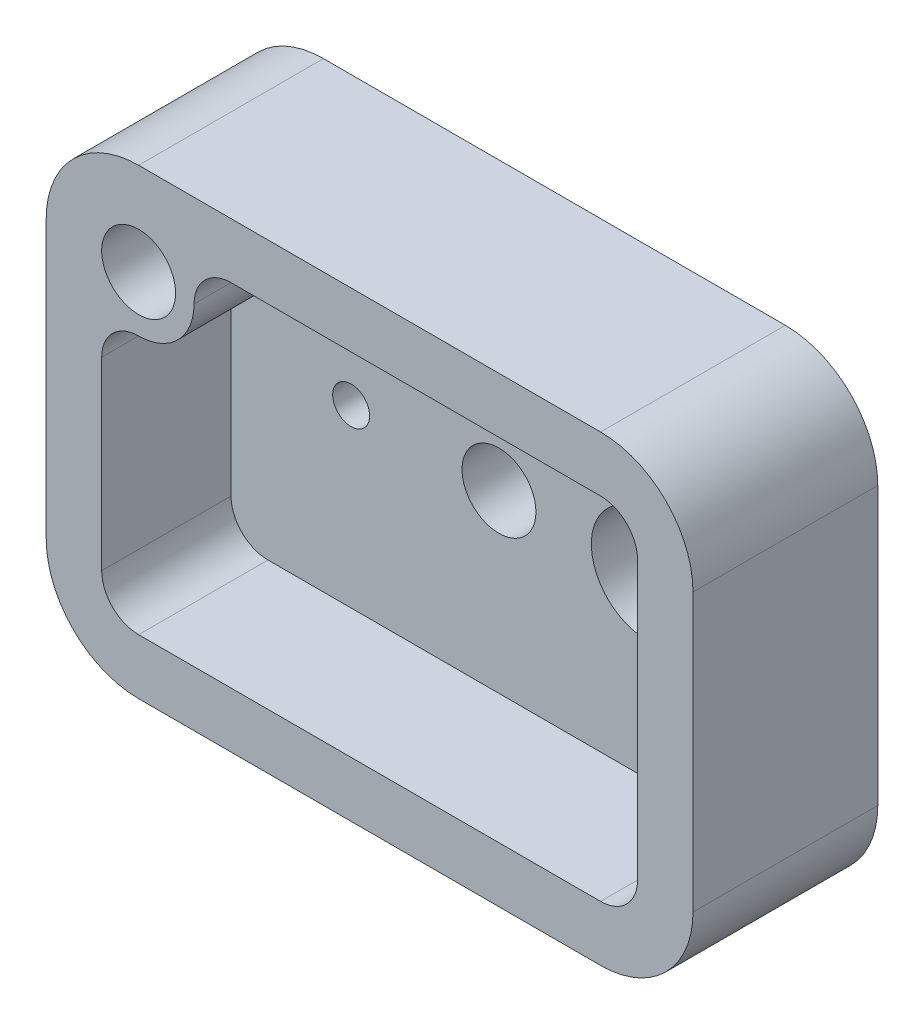
ISO-10303-21;
HEADER;
FILE_DESCRIPTION(('STEP AP214'),'2;1');
FILE_NAME('part.step','',(''),(''),'','','');
FILE_SCHEMA(('AUTOMOTIVE_DESIGN { 1 0 10303 214 1 1 1 1 }'));
ENDSEC;
DATA;
#1=APPLICATION_CONTEXT('core data for automotive mechanical design processes');
#2=APPLICATION_PROTOCOL_DEFINITION('international standard','automotive_design',2000,#1);
#3=PRODUCT_CONTEXT('',#1,'mechanical');
#4=PRODUCT('Part','Part','',(#3));
#5=PRODUCT_RELATED_PRODUCT_CATEGORY('part','',(#4));
#6=PRODUCT_DEFINITION_FORMATION('','',#4);
#7=PRODUCT_DEFINITION_CONTEXT('part definition',#1,'design');
#8=PRODUCT_DEFINITION('design','',#6,#7);
#9=PRODUCT_DEFINITION_SHAPE('','',#8);
#10=(LENGTH_UNIT() NAMED_UNIT(*) SI_UNIT(.MILLI.,.METRE.));
#11=(NAMED_UNIT(*) PLANE_ANGLE_UNIT() SI_UNIT($,.RADIAN.));
#12=(NAMED_UNIT(*) SI_UNIT($,.STERADIAN.) SOLID_ANGLE_UNIT());
#13=UNCERTAINTY_MEASURE_WITH_UNIT(LENGTH_MEASURE(1.E-05),#10,'distance_accuracy_value','');
#14=(GEOMETRIC_REPRESENTATION_CONTEXT(3) GLOBAL_UNCERTAINTY_ASSIGNED_CONTEXT((#13)) GLOBAL_UNIT_ASSIGNED_CONTEXT((#10,
#11,#12)) REPRESENTATION_CONTEXT('',''));
#15=CARTESIAN_POINT('',(0.,0.,0.));
#16=DIRECTION('',(0.,0.,1.));
#17=DIRECTION('',(1.,0.,0.));
#18=AXIS2_PLACEMENT_3D('',#15,#16,#17);
#19=CARTESIAN_POINT('',(17.5,12.5,0.));
#20=DIRECTION('',(0.,0.,1.));
#21=DIRECTION('',(1.,0.,0.));
#22=AXIS2_PLACEMENT_3D('',#19,#20,#21);
#23=PLANE('',#22);
#24=CARTESIAN_POINT('',(5.,20.,0.));
#25=DIRECTION('',(0.,0.,1.));
#26=DIRECTION('',(1.,0.,0.));
#27=AXIS2_PLACEMENT_3D('',#24,#25,#26);
#28=CIRCLE('',#27,2.);
#29=CARTESIAN_POINT('',(7.,20.,0.));
#30=VERTEX_POINT('',#29);
#31=EDGE_CURVE('E237',#30,#30,#28,.T.);
#32=ORIENTED_EDGE('',*,*,#31,.T.);
#33=EDGE_LOOP('',(#32));
#34=FACE_BOUND('',#33,.T.);
#35=ADVANCED_FACE('F47',(#34),#23,.T.);
#36=CARTESIAN_POINT('',(17.5,12.5,0.));
#37=DIRECTION('',(0.,0.,1.));
#38=DIRECTION('',(1.,0.,0.));
#39=AXIS2_PLACEMENT_3D('',#36,#37,#38);
#40=CIRCLE('',#39,2.);
#41=CARTESIAN_POINT('',(19.5,12.5,0.));
#42=VERTEX_POINT('',#41);
#43=EDGE_CURVE('E631',#42,#42,#40,.T.);
#44=ORIENTED_EDGE('',*,*,#43,.F.);
#45=EDGE_LOOP('',(#44));
#46=FACE_BOUND('',#45,.T.);
#47=CARTESIAN_POINT('',(9.49999999999999,12.5,0.));
#48=DIRECTION('',(0.,0.,1.));
#49=DIRECTION('',(1.,0.,0.));
#50=AXIS2_PLACEMENT_3D('',#47,#48,#49);
#51=CIRCLE('',#50,1.);
#52=CARTESIAN_POINT('',(10.5,12.5,0.));
#53=VERTEX_POINT('',#52);
#54=EDGE_CURVE('E628',#53,#53,#51,.T.);
#55=ORIENTED_EDGE('',*,*,#54,.F.);
#56=EDGE_LOOP('',(#55));
#57=FACE_BOUND('',#56,.T.);
#58=CARTESIAN_POINT('',(25.5,12.5,0.));
#59=DIRECTION('',(0.,0.,1.));
#60=DIRECTION('',(1.,0.,0.));
#61=AXIS2_PLACEMENT_3D('',#58,#59,#60);
#62=CIRCLE('',#61,3.);
#63=CARTESIAN_POINT('',(28.5,12.5,0.));
#64=VERTEX_POINT('',#63);
#65=EDGE_CURVE('E643',#64,#64,#62,.T.);
#66=ORIENTED_EDGE('',*,*,#65,.F.);
#67=EDGE_LOOP('',(#66));
#68=FACE_BOUND('',#67,.T.);
#69=DIRECTION('',(-1.,0.,0.));
#70=VECTOR('',#69,1.);
#71=CARTESIAN_POINT('',(17.5,22.,0.));
#72=LINE('',#71,#70);
#73=CARTESIAN_POINT('',(30.,22.,0.));
#74=VERTEX_POINT('',#73);
#75=CARTESIAN_POINT('',(10.,22.,0.));
#76=VERTEX_POINT('',#75);
#77=EDGE_CURVE('E255',#74,#76,#72,.T.);
#78=ORIENTED_EDGE('',*,*,#77,.T.);
#79=CARTESIAN_POINT('',(10.,20.,0.));
#80=DIRECTION('',(0.,0.,1.));
#81=DIRECTION('',(1.,0.,0.));
#82=AXIS2_PLACEMENT_3D('',#79,#80,#81);
#83=CIRCLE('',#82,2.);
#84=CARTESIAN_POINT('',(8.,20.,0.));
#85=VERTEX_POINT('',#84);
#86=EDGE_CURVE('E399',#76,#85,#83,.T.);
#87=ORIENTED_EDGE('',*,*,#86,.T.);
#88=CARTESIAN_POINT('',(5.,20.,0.));
#89=DIRECTION('',(0.,0.,1.));
#90=DIRECTION('',(1.,0.,0.));
#91=AXIS2_PLACEMENT_3D('',#88,#89,#90);
#92=CIRCLE('',#91,3.);
#93=CARTESIAN_POINT('',(5.,17.,0.));
#94=VERTEX_POINT('',#93);
#95=EDGE_CURVE('E220',#85,#94,#92,.F.);
#96=ORIENTED_EDGE('',*,*,#95,.T.);
#97=CARTESIAN_POINT('',(5.,15.,0.));
#98=DIRECTION('',(0.,0.,1.));
#99=DIRECTION('',(1.,0.,0.));
#100=AXIS2_PLACEMENT_3D('',#97,#98,#99);
#101=CIRCLE('',#100,2.);
#102=CARTESIAN_POINT('',(3.,15.,0.));
#103=VERTEX_POINT('',#102);
#104=EDGE_CURVE('E69',#94,#103,#101,.T.);
#105=ORIENTED_EDGE('',*,*,#104,.T.);
#106=DIRECTION('',(0.,-1.,0.));
#107=VECTOR('',#106,1.);
#108=CARTESIAN_POINT('',(3.,12.5,0.));
#109=LINE('',#108,#107);
#110=CARTESIAN_POINT('',(3.,5.,0.));
#111=VERTEX_POINT('',#110);
#112=EDGE_CURVE('E229',#103,#111,#109,.T.);
#113=ORIENTED_EDGE('',*,*,#112,.T.);
#114=CARTESIAN_POINT('',(5.,5.,0.));
#115=DIRECTION('',(0.,0.,1.));
#116=DIRECTION('',(1.,0.,0.));
#117=AXIS2_PLACEMENT_3D('',#114,#115,#116);
#118=CIRCLE('',#117,2.);
#119=CARTESIAN_POINT('',(5.,3.,0.));
#120=VERTEX_POINT('',#119);
#121=EDGE_CURVE('E318',#111,#120,#118,.T.);
#122=ORIENTED_EDGE('',*,*,#121,.T.);
#123=DIRECTION('',(1.,0.,0.));
#124=VECTOR('',#123,1.);
#125=CARTESIAN_POINT('',(17.5,3.,0.));
#126=LINE('',#125,#124);
#127=CARTESIAN_POINT('',(30.,3.,0.));
#128=VERTEX_POINT('',#127);
#129=EDGE_CURVE('E273',#120,#128,#126,.T.);
#130=ORIENTED_EDGE('',*,*,#129,.T.);
#131=CARTESIAN_POINT('',(30.,5.,0.));
#132=DIRECTION('',(0.,0.,1.));
#133=DIRECTION('',(1.,0.,0.));
#134=AXIS2_PLACEMENT_3D('',#131,#132,#133);
#135=CIRCLE('',#134,2.);
#136=CARTESIAN_POINT('',(32.,5.,0.));
#137=VERTEX_POINT('',#136);
#138=EDGE_CURVE('E236',#128,#137,#135,.T.);
#139=ORIENTED_EDGE('',*,*,#138,.T.);
#140=DIRECTION('',(0.,1.,0.));
#141=VECTOR('',#140,1.);
#142=CARTESIAN_POINT('',(32.,12.5,0.));
#143=LINE('',#142,#141);
#144=CARTESIAN_POINT('',(32.,20.,0.));
#145=VERTEX_POINT('',#144);
#146=EDGE_CURVE('E267',#137,#145,#143,.T.);
#147=ORIENTED_EDGE('',*,*,#146,.T.);
#148=CARTESIAN_POINT('',(30.,20.,0.));
#149=DIRECTION('',(0.,0.,1.));
#150=DIRECTION('',(1.,0.,0.));
#151=AXIS2_PLACEMENT_3D('',#148,#149,#150);
#152=CIRCLE('',#151,2.);
#153=EDGE_CURVE('E289',#145,#74,#152,.T.);
#154=ORIENTED_EDGE('',*,*,#153,.T.);
#155=EDGE_LOOP('',(#78,#87,#96,#105,#113,#122,#130,#139,#147,#154));
#156=FACE_BOUND('',#155,.T.);
#157=ADVANCED_FACE('F412',(#46,#57,#68,#156),#23,.T.);
#158=CARTESIAN_POINT('',(17.5,12.5,7.));
#159=DIRECTION('',(0.,0.,1.));
#160=DIRECTION('',(1.,0.,0.));
#161=AXIS2_PLACEMENT_3D('',#158,#159,#160);
#162=PLANE('',#161);
#163=CARTESIAN_POINT('',(5.,20.,7.));
#164=DIRECTION('',(0.,0.,1.));
#165=DIRECTION('',(1.,0.,0.));
#166=AXIS2_PLACEMENT_3D('',#163,#164,#165);
#167=CIRCLE('',#166,2.);
#168=CARTESIAN_POINT('',(7.,20.,7.));
#169=VERTEX_POINT('',#168);
#170=EDGE_CURVE('E241',#169,#169,#167,.T.);
#171=ORIENTED_EDGE('',*,*,#170,.F.);
#172=EDGE_LOOP('',(#171));
#173=FACE_BOUND('',#172,.T.);
#174=DIRECTION('',(1.,0.,0.));
#175=VECTOR('',#174,1.);
#176=CARTESIAN_POINT('',(17.5,25.,7.));
#177=LINE('',#176,#175);
#178=CARTESIAN_POINT('',(5.,25.,7.));
#179=VERTEX_POINT('',#178);
#180=CARTESIAN_POINT('',(30.,25.,7.));
#181=VERTEX_POINT('',#180);
#182=EDGE_CURVE('E363',#179,#181,#177,.T.);
#183=ORIENTED_EDGE('',*,*,#182,.F.);
#184=CARTESIAN_POINT('',(5.,20.,7.));
#185=DIRECTION('',(0.,0.,1.));
#186=DIRECTION('',(1.,0.,0.));
#187=AXIS2_PLACEMENT_3D('',#184,#185,#186);
#188=CIRCLE('',#187,5.);
#189=CARTESIAN_POINT('',(0.,20.,7.));
#190=VERTEX_POINT('',#189);
#191=EDGE_CURVE('E295',#179,#190,#188,.T.);
#192=ORIENTED_EDGE('',*,*,#191,.T.);
#193=DIRECTION('',(0.,1.,0.));
#194=VECTOR('',#193,1.);
#195=CARTESIAN_POINT('',(0.,12.5,7.));
#196=LINE('',#195,#194);
#197=CARTESIAN_POINT('',(0.,5.,7.));
#198=VERTEX_POINT('',#197);
#199=EDGE_CURVE('E260',#198,#190,#196,.T.);
#200=ORIENTED_EDGE('',*,*,#199,.F.);
#201=CARTESIAN_POINT('',(5.,5.,7.));
#202=DIRECTION('',(0.,0.,1.));
#203=DIRECTION('',(1.,0.,0.));
#204=AXIS2_PLACEMENT_3D('',#201,#202,#203);
#205=CIRCLE('',#204,5.);
#206=CARTESIAN_POINT('',(5.,0.,7.));
#207=VERTEX_POINT('',#206);
#208=EDGE_CURVE('E242',#198,#207,#205,.T.);
#209=ORIENTED_EDGE('',*,*,#208,.T.);
#210=DIRECTION('',(1.,0.,0.));
#211=VECTOR('',#210,1.);
#212=CARTESIAN_POINT('',(17.5,0.,7.));
#213=LINE('',#212,#211);
#214=CARTESIAN_POINT('',(30.,0.,7.));
#215=VERTEX_POINT('',#214);
#216=EDGE_CURVE('E311',#207,#215,#213,.T.);
#217=ORIENTED_EDGE('',*,*,#216,.T.);
#218=CARTESIAN_POINT('',(30.,5.,7.));
#219=DIRECTION('',(0.,0.,1.));
#220=DIRECTION('',(1.,0.,0.));
#221=AXIS2_PLACEMENT_3D('',#218,#219,#220);
#222=CIRCLE('',#221,5.);
#223=CARTESIAN_POINT('',(35.,5.,7.));
#224=VERTEX_POINT('',#223);
#225=EDGE_CURVE('E317',#215,#224,#222,.T.);
#226=ORIENTED_EDGE('',*,*,#225,.T.);
#227=DIRECTION('',(0.,1.,0.));
#228=VECTOR('',#227,1.);
#229=CARTESIAN_POINT('',(35.,12.5,7.));
#230=LINE('',#229,#228);
#231=CARTESIAN_POINT('',(35.,20.,7.));
#232=VERTEX_POINT('',#231);
#233=EDGE_CURVE('E288',#224,#232,#230,.T.);
#234=ORIENTED_EDGE('',*,*,#233,.T.);
#235=CARTESIAN_POINT('',(30.,20.,7.));
#236=DIRECTION('',(0.,0.,1.));
#237=DIRECTION('',(1.,0.,0.));
#238=AXIS2_PLACEMENT_3D('',#235,#236,#237);
#239=CIRCLE('',#238,5.);
#240=EDGE_CURVE('E287',#232,#181,#239,.T.);
#241=ORIENTED_EDGE('',*,*,#240,.T.);
#242=EDGE_LOOP('',(#183,#192,#200,#209,#217,#226,#234,#241));
#243=FACE_BOUND('',#242,.T.);
#244=CARTESIAN_POINT('',(30.,20.,7.));
#245=DIRECTION('',(0.,0.,1.));
#246=DIRECTION('',(1.,0.,0.));
#247=AXIS2_PLACEMENT_3D('',#244,#245,#246);
#248=CIRCLE('',#247,2.);
#249=CARTESIAN_POINT('',(32.,20.,7.));
#250=VERTEX_POINT('',#249);
#251=CARTESIAN_POINT('',(30.,22.,7.));
#252=VERTEX_POINT('',#251);
#253=EDGE_CURVE('E306',#250,#252,#248,.T.);
#254=ORIENTED_EDGE('',*,*,#253,.F.);
#255=DIRECTION('',(0.,1.,0.));
#256=VECTOR('',#255,1.);
#257=CARTESIAN_POINT('',(32.,12.5,7.));
#258=LINE('',#257,#256);
#259=CARTESIAN_POINT('',(32.,5.,7.));
#260=VERTEX_POINT('',#259);
#261=EDGE_CURVE('E266',#260,#250,#258,.T.);
#262=ORIENTED_EDGE('',*,*,#261,.F.);
#263=CARTESIAN_POINT('',(30.,5.,7.));
#264=DIRECTION('',(0.,0.,1.));
#265=DIRECTION('',(1.,0.,0.));
#266=AXIS2_PLACEMENT_3D('',#263,#264,#265);
#267=CIRCLE('',#266,2.);
#268=CARTESIAN_POINT('',(30.,3.,7.));
#269=VERTEX_POINT('',#268);
#270=EDGE_CURVE('E235',#269,#260,#267,.T.);
#271=ORIENTED_EDGE('',*,*,#270,.F.);
#272=DIRECTION('',(1.,0.,0.));
#273=VECTOR('',#272,1.);
#274=CARTESIAN_POINT('',(17.5,3.,7.));
#275=LINE('',#274,#273);
#276=CARTESIAN_POINT('',(5.,3.,7.));
#277=VERTEX_POINT('',#276);
#278=EDGE_CURVE('E272',#277,#269,#275,.T.);
#279=ORIENTED_EDGE('',*,*,#278,.F.);
#280=CARTESIAN_POINT('',(5.,5.,7.));
#281=DIRECTION('',(0.,0.,1.));
#282=DIRECTION('',(1.,0.,0.));
#283=AXIS2_PLACEMENT_3D('',#280,#281,#282);
#284=CIRCLE('',#283,2.);
#285=CARTESIAN_POINT('',(3.,5.,7.));
#286=VERTEX_POINT('',#285);
#287=EDGE_CURVE('E226',#286,#277,#284,.T.);
#288=ORIENTED_EDGE('',*,*,#287,.F.);
#289=DIRECTION('',(0.,-1.,0.));
#290=VECTOR('',#289,1.);
#291=CARTESIAN_POINT('',(3.,12.5,7.));
#292=LINE('',#291,#290);
#293=CARTESIAN_POINT('',(3.,15.,7.));
#294=VERTEX_POINT('',#293);
#295=EDGE_CURVE('E205',#294,#286,#292,.T.);
#296=ORIENTED_EDGE('',*,*,#295,.F.);
#297=CARTESIAN_POINT('',(5.,15.,7.));
#298=DIRECTION('',(0.,0.,1.));
#299=DIRECTION('',(1.,0.,0.));
#300=AXIS2_PLACEMENT_3D('',#297,#298,#299);
#301=CIRCLE('',#300,2.);
#302=CARTESIAN_POINT('',(5.,17.,7.));
#303=VERTEX_POINT('',#302);
#304=EDGE_CURVE('E11',#294,#303,#301,.F.);
#305=ORIENTED_EDGE('',*,*,#304,.T.);
#306=CARTESIAN_POINT('',(5.,20.,7.));
#307=DIRECTION('',(0.,0.,1.));
#308=DIRECTION('',(1.,0.,0.));
#309=AXIS2_PLACEMENT_3D('',#306,#307,#308);
#310=CIRCLE('',#309,3.);
#311=CARTESIAN_POINT('',(8.,20.,7.));
#312=VERTEX_POINT('',#311);
#313=EDGE_CURVE('E203',#303,#312,#310,.T.);
#314=ORIENTED_EDGE('',*,*,#313,.T.);
#315=CARTESIAN_POINT('',(10.,20.,7.));
#316=DIRECTION('',(0.,0.,1.));
#317=DIRECTION('',(1.,0.,0.));
#318=AXIS2_PLACEMENT_3D('',#315,#316,#317);
#319=CIRCLE('',#318,2.);
#320=CARTESIAN_POINT('',(10.,22.,7.));
#321=VERTEX_POINT('',#320);
#322=EDGE_CURVE('E56',#312,#321,#319,.F.);
#323=ORIENTED_EDGE('',*,*,#322,.T.);
#324=DIRECTION('',(-1.,0.,0.));
#325=VECTOR('',#324,1.);
#326=CARTESIAN_POINT('',(17.5,22.,7.));
#327=LINE('',#326,#325);
#328=EDGE_CURVE('E250',#252,#321,#327,.T.);
#329=ORIENTED_EDGE('',*,*,#328,.F.);
#330=EDGE_LOOP('',(#254,#262,#271,#279,#288,#296,#305,#314,#323,#329));
#331=FACE_BOUND('',#330,.T.);
#332=ADVANCED_FACE('F202',(#173,#243,#331),#162,.T.);
#333=CARTESIAN_POINT('',(17.5,22.,7.));
#334=DIRECTION('',(0.,-1.,0.));
#335=DIRECTION('',(0.,0.,-1.));
#336=AXIS2_PLACEMENT_3D('',#333,#334,#335);
#337=PLANE('',#336);
#338=ORIENTED_EDGE('',*,*,#328,.T.);
#339=DIRECTION('',(0.,0.,1.));
#340=VECTOR('',#339,1.);
#341=CARTESIAN_POINT('',(10.,22.,0.));
#342=LINE('',#341,#340);
#343=EDGE_CURVE('E254',#321,#76,#342,.F.);
#344=ORIENTED_EDGE('',*,*,#343,.T.);
#345=ORIENTED_EDGE('',*,*,#77,.F.);
#346=DIRECTION('',(0.,0.,-1.));
#347=VECTOR('',#346,1.);
#348=CARTESIAN_POINT('',(30.,22.,7.));
#349=LINE('',#348,#347);
#350=EDGE_CURVE('E302',#252,#74,#349,.T.);
#351=ORIENTED_EDGE('',*,*,#350,.F.);
#352=EDGE_LOOP('',(#338,#344,#345,#351));
#353=FACE_BOUND('',#352,.T.);
#354=ADVANCED_FACE('F409',(#353),#337,.T.);
#355=CARTESIAN_POINT('',(5.,20.,7.));
#356=DIRECTION('',(0.,0.,-1.));
#357=DIRECTION('',(-1.,0.,0.));
#358=AXIS2_PLACEMENT_3D('',#355,#356,#357);
#359=CYLINDRICAL_SURFACE('',#358,2.);
#360=ORIENTED_EDGE('',*,*,#31,.F.);
#361=EDGE_LOOP('',(#360));
#362=FACE_BOUND('',#361,.T.);
#363=ORIENTED_EDGE('',*,*,#170,.T.);
#364=EDGE_LOOP('',(#363));
#365=FACE_BOUND('',#364,.T.);
#366=ADVANCED_FACE('F439',(#362,#365),#359,.F.);
#367=CARTESIAN_POINT('',(3.,12.5,7.));
#368=DIRECTION('',(1.,0.,0.));
#369=DIRECTION('',(0.,1.,0.));
#370=AXIS2_PLACEMENT_3D('',#367,#368,#369);
#371=PLANE('',#370);
#372=ORIENTED_EDGE('',*,*,#112,.F.);
#373=DIRECTION('',(0.,0.,1.));
#374=VECTOR('',#373,1.);
#375=CARTESIAN_POINT('',(3.,15.,7.));
#376=LINE('',#375,#374);
#377=EDGE_CURVE('E402',#103,#294,#376,.T.);
#378=ORIENTED_EDGE('',*,*,#377,.T.);
#379=ORIENTED_EDGE('',*,*,#295,.T.);
#380=DIRECTION('',(0.,0.,-1.));
#381=VECTOR('',#380,1.);
#382=CARTESIAN_POINT('',(3.,5.,7.));
#383=LINE('',#382,#381);
#384=EDGE_CURVE('E230',#286,#111,#383,.T.);
#385=ORIENTED_EDGE('',*,*,#384,.T.);
#386=EDGE_LOOP('',(#372,#378,#379,#385));
#387=FACE_BOUND('',#386,.T.);
#388=ADVANCED_FACE('F437',(#387),#371,.T.);
#389=CARTESIAN_POINT('',(5.,5.,7.));
#390=DIRECTION('',(0.,0.,-1.));
#391=DIRECTION('',(-1.,0.,0.));
#392=AXIS2_PLACEMENT_3D('',#389,#390,#391);
#393=CYLINDRICAL_SURFACE('',#392,2.);
#394=ORIENTED_EDGE('',*,*,#121,.F.);
#395=ORIENTED_EDGE('',*,*,#384,.F.);
#396=ORIENTED_EDGE('',*,*,#287,.T.);
#397=DIRECTION('',(0.,0.,-1.));
#398=VECTOR('',#397,1.);
#399=CARTESIAN_POINT('',(5.,3.,7.));
#400=LINE('',#399,#398);
#401=EDGE_CURVE('E268',#277,#120,#400,.T.);
#402=ORIENTED_EDGE('',*,*,#401,.T.);
#403=EDGE_LOOP('',(#394,#395,#396,#402));
#404=FACE_BOUND('',#403,.T.);
#405=ADVANCED_FACE('F435',(#404),#393,.F.);
#406=CARTESIAN_POINT('',(17.5,3.,7.));
#407=DIRECTION('',(0.,1.,0.));
#408=DIRECTION('',(1.,0.,0.));
#409=AXIS2_PLACEMENT_3D('',#406,#407,#408);
#410=PLANE('',#409);
#411=ORIENTED_EDGE('',*,*,#129,.F.);
#412=ORIENTED_EDGE('',*,*,#401,.F.);
#413=ORIENTED_EDGE('',*,*,#278,.T.);
#414=DIRECTION('',(0.,0.,-1.));
#415=VECTOR('',#414,1.);
#416=CARTESIAN_POINT('',(30.,3.,7.));
#417=LINE('',#416,#415);
#418=EDGE_CURVE('E231',#269,#128,#417,.T.);
#419=ORIENTED_EDGE('',*,*,#418,.T.);
#420=EDGE_LOOP('',(#411,#412,#413,#419));
#421=FACE_BOUND('',#420,.T.);
#422=ADVANCED_FACE('F430',(#421),#410,.T.);
#423=CARTESIAN_POINT('',(30.,5.,7.));
#424=DIRECTION('',(0.,0.,-1.));
#425=DIRECTION('',(-1.,0.,0.));
#426=AXIS2_PLACEMENT_3D('',#423,#424,#425);
#427=CYLINDRICAL_SURFACE('',#426,2.);
#428=ORIENTED_EDGE('',*,*,#138,.F.);
#429=ORIENTED_EDGE('',*,*,#418,.F.);
#430=ORIENTED_EDGE('',*,*,#270,.T.);
#431=DIRECTION('',(0.,0.,-1.));
#432=VECTOR('',#431,1.);
#433=CARTESIAN_POINT('',(32.,5.,7.));
#434=LINE('',#433,#432);
#435=EDGE_CURVE('E262',#260,#137,#434,.T.);
#436=ORIENTED_EDGE('',*,*,#435,.T.);
#437=EDGE_LOOP('',(#428,#429,#430,#436));
#438=FACE_BOUND('',#437,.T.);
#439=ADVANCED_FACE('F427',(#438),#427,.F.);
#440=CARTESIAN_POINT('',(32.,12.5,7.));
#441=DIRECTION('',(-1.,0.,0.));
#442=DIRECTION('',(0.,0.,1.));
#443=AXIS2_PLACEMENT_3D('',#440,#441,#442);
#444=PLANE('',#443);
#445=ORIENTED_EDGE('',*,*,#146,.F.);
#446=ORIENTED_EDGE('',*,*,#435,.F.);
#447=ORIENTED_EDGE('',*,*,#261,.T.);
#448=DIRECTION('',(0.,0.,-1.));
#449=VECTOR('',#448,1.);
#450=CARTESIAN_POINT('',(32.,20.,7.));
#451=LINE('',#450,#449);
#452=EDGE_CURVE('E293',#250,#145,#451,.T.);
#453=ORIENTED_EDGE('',*,*,#452,.T.);
#454=EDGE_LOOP('',(#445,#446,#447,#453));
#455=FACE_BOUND('',#454,.T.);
#456=ADVANCED_FACE('F424',(#455),#444,.T.);
#457=CARTESIAN_POINT('',(30.,20.,7.));
#458=DIRECTION('',(0.,0.,-1.));
#459=DIRECTION('',(-1.,0.,0.));
#460=AXIS2_PLACEMENT_3D('',#457,#458,#459);
#461=CYLINDRICAL_SURFACE('',#460,2.);
#462=ORIENTED_EDGE('',*,*,#153,.F.);
#463=ORIENTED_EDGE('',*,*,#452,.F.);
#464=ORIENTED_EDGE('',*,*,#253,.T.);
#465=ORIENTED_EDGE('',*,*,#350,.T.);
#466=EDGE_LOOP('',(#462,#463,#464,#465));
#467=FACE_BOUND('',#466,.T.);
#468=ADVANCED_FACE('F415',(#467),#461,.F.);
#469=CARTESIAN_POINT('',(17.5,12.5,-3.));
#470=DIRECTION('',(0.,0.,1.));
#471=DIRECTION('',(1.,0.,0.));
#472=AXIS2_PLACEMENT_3D('',#469,#470,#471);
#473=PLANE('',#472);
#474=CARTESIAN_POINT('',(9.49999999999999,12.5,-3.));
#475=DIRECTION('',(0.,0.,1.));
#476=DIRECTION('',(1.,0.,0.));
#477=AXIS2_PLACEMENT_3D('',#474,#475,#476);
#478=CIRCLE('',#477,1.);
#479=CARTESIAN_POINT('',(10.5,12.5,-3.));
#480=VERTEX_POINT('',#479);
#481=EDGE_CURVE('E215',#480,#480,#478,.T.);
#482=ORIENTED_EDGE('',*,*,#481,.T.);
#483=EDGE_LOOP('',(#482));
#484=FACE_BOUND('',#483,.T.);
#485=CARTESIAN_POINT('',(17.5,12.5,-3.));
#486=DIRECTION('',(0.,0.,1.));
#487=DIRECTION('',(1.,0.,0.));
#488=AXIS2_PLACEMENT_3D('',#485,#486,#487);
#489=CIRCLE('',#488,2.);
#490=CARTESIAN_POINT('',(19.5,12.5,-3.));
#491=VERTEX_POINT('',#490);
#492=EDGE_CURVE('E637',#491,#491,#489,.T.);
#493=ORIENTED_EDGE('',*,*,#492,.T.);
#494=EDGE_LOOP('',(#493));
#495=FACE_BOUND('',#494,.T.);
#496=CARTESIAN_POINT('',(25.5,12.5,-3.));
#497=DIRECTION('',(0.,0.,1.));
#498=DIRECTION('',(1.,0.,0.));
#499=AXIS2_PLACEMENT_3D('',#496,#497,#498);
#500=CIRCLE('',#499,3.);
#501=CARTESIAN_POINT('',(28.5,12.5,-3.));
#502=VERTEX_POINT('',#501);
#503=EDGE_CURVE('E647',#502,#502,#500,.T.);
#504=ORIENTED_EDGE('',*,*,#503,.T.);
#505=EDGE_LOOP('',(#504));
#506=FACE_BOUND('',#505,.T.);
#507=DIRECTION('',(1.,0.,0.));
#508=VECTOR('',#507,1.);
#509=CARTESIAN_POINT('',(17.5,25.,-3.));
#510=LINE('',#509,#508);
#511=CARTESIAN_POINT('',(5.,25.,-3.));
#512=VERTEX_POINT('',#511);
#513=CARTESIAN_POINT('',(30.,25.,-3.));
#514=VERTEX_POINT('',#513);
#515=EDGE_CURVE('E274',#512,#514,#510,.T.);
#516=ORIENTED_EDGE('',*,*,#515,.T.);
#517=CARTESIAN_POINT('',(30.,20.,-3.));
#518=DIRECTION('',(0.,0.,1.));
#519=DIRECTION('',(1.,0.,0.));
#520=AXIS2_PLACEMENT_3D('',#517,#518,#519);
#521=CIRCLE('',#520,5.);
#522=CARTESIAN_POINT('',(35.,20.,-3.));
#523=VERTEX_POINT('',#522);
#524=EDGE_CURVE('E294',#523,#514,#521,.T.);
#525=ORIENTED_EDGE('',*,*,#524,.F.);
#526=DIRECTION('',(0.,1.,0.));
#527=VECTOR('',#526,1.);
#528=CARTESIAN_POINT('',(35.,12.5,-3.));
#529=LINE('',#528,#527);
#530=CARTESIAN_POINT('',(35.,5.,-3.));
#531=VERTEX_POINT('',#530);
#532=EDGE_CURVE('E283',#531,#523,#529,.T.);
#533=ORIENTED_EDGE('',*,*,#532,.F.);
#534=CARTESIAN_POINT('',(30.,5.,-3.));
#535=DIRECTION('',(0.,0.,1.));
#536=DIRECTION('',(1.,0.,0.));
#537=AXIS2_PLACEMENT_3D('',#534,#535,#536);
#538=CIRCLE('',#537,5.);
#539=CARTESIAN_POINT('',(30.,0.,-3.));
#540=VERTEX_POINT('',#539);
#541=EDGE_CURVE('E312',#540,#531,#538,.T.);
#542=ORIENTED_EDGE('',*,*,#541,.F.);
#543=DIRECTION('',(1.,0.,0.));
#544=VECTOR('',#543,1.);
#545=CARTESIAN_POINT('',(17.5,0.,-3.));
#546=LINE('',#545,#544);
#547=CARTESIAN_POINT('',(5.,0.,-3.));
#548=VERTEX_POINT('',#547);
#549=EDGE_CURVE('E321',#548,#540,#546,.T.);
#550=ORIENTED_EDGE('',*,*,#549,.F.);
#551=CARTESIAN_POINT('',(5.,5.,-3.));
#552=DIRECTION('',(0.,0.,1.));
#553=DIRECTION('',(1.,0.,0.));
#554=AXIS2_PLACEMENT_3D('',#551,#552,#553);
#555=CIRCLE('',#554,5.);
#556=CARTESIAN_POINT('',(0.,5.,-3.));
#557=VERTEX_POINT('',#556);
#558=EDGE_CURVE('E246',#557,#548,#555,.T.);
#559=ORIENTED_EDGE('',*,*,#558,.F.);
#560=DIRECTION('',(0.,1.,0.));
#561=VECTOR('',#560,1.);
#562=CARTESIAN_POINT('',(0.,12.5,-3.));
#563=LINE('',#562,#561);
#564=CARTESIAN_POINT('',(0.,20.,-3.));
#565=VERTEX_POINT('',#564);
#566=EDGE_CURVE('E280',#557,#565,#563,.T.);
#567=ORIENTED_EDGE('',*,*,#566,.T.);
#568=CARTESIAN_POINT('',(5.,20.,-3.));
#569=DIRECTION('',(0.,0.,1.));
#570=DIRECTION('',(1.,0.,0.));
#571=AXIS2_PLACEMENT_3D('',#568,#569,#570);
#572=CIRCLE('',#571,5.);
#573=EDGE_CURVE('E261',#512,#565,#572,.T.);
#574=ORIENTED_EDGE('',*,*,#573,.F.);
#575=EDGE_LOOP('',(#516,#525,#533,#542,#550,#559,#567,#574));
#576=FACE_BOUND('',#575,.T.);
#577=ADVANCED_FACE('F475',(#484,#495,#506,#576),#473,.F.);
#578=CARTESIAN_POINT('',(30.,20.,-3.));
#579=DIRECTION('',(0.,0.,1.));
#580=DIRECTION('',(1.,0.,0.));
#581=AXIS2_PLACEMENT_3D('',#578,#579,#580);
#582=CYLINDRICAL_SURFACE('',#581,5.);
#583=DIRECTION('',(0.,0.,1.));
#584=VECTOR('',#583,1.);
#585=CARTESIAN_POINT('',(30.,25.,-3.));
#586=LINE('',#585,#584);
#587=EDGE_CURVE('E279',#514,#181,#586,.T.);
#588=ORIENTED_EDGE('',*,*,#587,.T.);
#589=ORIENTED_EDGE('',*,*,#240,.F.);
#590=DIRECTION('',(0.,0.,1.));
#591=VECTOR('',#590,1.);
#592=CARTESIAN_POINT('',(35.,20.,-3.));
#593=LINE('',#592,#591);
#594=EDGE_CURVE('E316',#523,#232,#593,.T.);
#595=ORIENTED_EDGE('',*,*,#594,.F.);
#596=ORIENTED_EDGE('',*,*,#524,.T.);
#597=EDGE_LOOP('',(#588,#589,#595,#596));
#598=FACE_BOUND('',#597,.T.);
#599=ADVANCED_FACE('F478',(#598),#582,.T.);
#600=CARTESIAN_POINT('',(35.,12.5,-3.));
#601=DIRECTION('',(1.,0.,0.));
#602=DIRECTION('',(0.,1.,0.));
#603=AXIS2_PLACEMENT_3D('',#600,#601,#602);
#604=PLANE('',#603);
#605=ORIENTED_EDGE('',*,*,#594,.T.);
#606=ORIENTED_EDGE('',*,*,#233,.F.);
#607=DIRECTION('',(0.,0.,1.));
#608=VECTOR('',#607,1.);
#609=CARTESIAN_POINT('',(35.,5.,-3.));
#610=LINE('',#609,#608);
#611=EDGE_CURVE('E325',#531,#224,#610,.T.);
#612=ORIENTED_EDGE('',*,*,#611,.F.);
#613=ORIENTED_EDGE('',*,*,#532,.T.);
#614=EDGE_LOOP('',(#605,#606,#612,#613));
#615=FACE_BOUND('',#614,.T.);
#616=ADVANCED_FACE('F481',(#615),#604,.T.);
#617=CARTESIAN_POINT('',(30.,5.,-3.));
#618=DIRECTION('',(0.,0.,1.));
#619=DIRECTION('',(1.,0.,0.));
#620=AXIS2_PLACEMENT_3D('',#617,#618,#619);
#621=CYLINDRICAL_SURFACE('',#620,5.);
#622=ORIENTED_EDGE('',*,*,#611,.T.);
#623=ORIENTED_EDGE('',*,*,#225,.F.);
#624=DIRECTION('',(0.,0.,1.));
#625=VECTOR('',#624,1.);
#626=CARTESIAN_POINT('',(30.,0.,-3.));
#627=LINE('',#626,#625);
#628=EDGE_CURVE('E307',#540,#215,#627,.T.);
#629=ORIENTED_EDGE('',*,*,#628,.F.);
#630=ORIENTED_EDGE('',*,*,#541,.T.);
#631=EDGE_LOOP('',(#622,#623,#629,#630));
#632=FACE_BOUND('',#631,.T.);
#633=ADVANCED_FACE('F484',(#632),#621,.T.);
#634=CARTESIAN_POINT('',(17.5,0.,-3.));
#635=DIRECTION('',(0.,-1.,0.));
#636=DIRECTION('',(0.,0.,-1.));
#637=AXIS2_PLACEMENT_3D('',#634,#635,#636);
#638=PLANE('',#637);
#639=ORIENTED_EDGE('',*,*,#628,.T.);
#640=ORIENTED_EDGE('',*,*,#216,.F.);
#641=DIRECTION('',(0.,0.,1.));
#642=VECTOR('',#641,1.);
#643=CARTESIAN_POINT('',(5.,0.,-3.));
#644=LINE('',#643,#642);
#645=EDGE_CURVE('E247',#548,#207,#644,.T.);
#646=ORIENTED_EDGE('',*,*,#645,.F.);
#647=ORIENTED_EDGE('',*,*,#549,.T.);
#648=EDGE_LOOP('',(#639,#640,#646,#647));
#649=FACE_BOUND('',#648,.T.);
#650=ADVANCED_FACE('F473',(#649),#638,.T.);
#651=CARTESIAN_POINT('',(5.,5.,-3.));
#652=DIRECTION('',(0.,0.,1.));
#653=DIRECTION('',(1.,0.,0.));
#654=AXIS2_PLACEMENT_3D('',#651,#652,#653);
#655=CYLINDRICAL_SURFACE('',#654,5.);
#656=ORIENTED_EDGE('',*,*,#645,.T.);
#657=ORIENTED_EDGE('',*,*,#208,.F.);
#658=DIRECTION('',(0.,0.,1.));
#659=VECTOR('',#658,1.);
#660=CARTESIAN_POINT('',(0.,5.,-3.));
#661=LINE('',#660,#659);
#662=EDGE_CURVE('E256',#557,#198,#661,.T.);
#663=ORIENTED_EDGE('',*,*,#662,.F.);
#664=ORIENTED_EDGE('',*,*,#558,.T.);
#665=EDGE_LOOP('',(#656,#657,#663,#664));
#666=FACE_BOUND('',#665,.T.);
#667=ADVANCED_FACE('F470',(#666),#655,.T.);
#668=CARTESIAN_POINT('',(0.,12.5,-3.));
#669=DIRECTION('',(1.,0.,0.));
#670=DIRECTION('',(0.,1.,0.));
#671=AXIS2_PLACEMENT_3D('',#668,#669,#670);
#672=PLANE('',#671);
#673=ORIENTED_EDGE('',*,*,#662,.T.);
#674=ORIENTED_EDGE('',*,*,#199,.T.);
#675=DIRECTION('',(0.,0.,1.));
#676=VECTOR('',#675,1.);
#677=CARTESIAN_POINT('',(0.,20.,-3.));
#678=LINE('',#677,#676);
#679=EDGE_CURVE('E278',#565,#190,#678,.T.);
#680=ORIENTED_EDGE('',*,*,#679,.F.);
#681=ORIENTED_EDGE('',*,*,#566,.F.);
#682=EDGE_LOOP('',(#673,#674,#680,#681));
#683=FACE_BOUND('',#682,.T.);
#684=ADVANCED_FACE('F467',(#683),#672,.F.);
#685=CARTESIAN_POINT('',(5.,20.,-3.));
#686=DIRECTION('',(0.,0.,1.));
#687=DIRECTION('',(1.,0.,0.));
#688=AXIS2_PLACEMENT_3D('',#685,#686,#687);
#689=CYLINDRICAL_SURFACE('',#688,5.);
#690=ORIENTED_EDGE('',*,*,#679,.T.);
#691=ORIENTED_EDGE('',*,*,#191,.F.);
#692=DIRECTION('',(0.,0.,1.));
#693=VECTOR('',#692,1.);
#694=CARTESIAN_POINT('',(5.,25.,-3.));
#695=LINE('',#694,#693);
#696=EDGE_CURVE('E225',#512,#179,#695,.T.);
#697=ORIENTED_EDGE('',*,*,#696,.F.);
#698=ORIENTED_EDGE('',*,*,#573,.T.);
#699=EDGE_LOOP('',(#690,#691,#697,#698));
#700=FACE_BOUND('',#699,.T.);
#701=ADVANCED_FACE('F464',(#700),#689,.T.);
#702=CARTESIAN_POINT('',(17.5,25.,-3.));
#703=DIRECTION('',(0.,-1.,0.));
#704=DIRECTION('',(0.,0.,-1.));
#705=AXIS2_PLACEMENT_3D('',#702,#703,#704);
#706=PLANE('',#705);
#707=ORIENTED_EDGE('',*,*,#696,.T.);
#708=ORIENTED_EDGE('',*,*,#182,.T.);
#709=ORIENTED_EDGE('',*,*,#587,.F.);
#710=ORIENTED_EDGE('',*,*,#515,.F.);
#711=EDGE_LOOP('',(#707,#708,#709,#710));
#712=FACE_BOUND('',#711,.T.);
#713=ADVANCED_FACE('F466',(#712),#706,.F.);
#714=CARTESIAN_POINT('',(5.,20.,-7.07106781186547));
#715=DIRECTION('',(0.,0.,1.));
#716=DIRECTION('',(1.,0.,0.));
#717=AXIS2_PLACEMENT_3D('',#714,#715,#716);
#718=CYLINDRICAL_SURFACE('',#717,3.);
#719=ORIENTED_EDGE('',*,*,#95,.F.);
#720=DIRECTION('',(0.,0.,1.));
#721=VECTOR('',#720,1.);
#722=CARTESIAN_POINT('',(8.,20.,-7.07106781186547));
#723=LINE('',#722,#721);
#724=EDGE_CURVE('E213',#85,#312,#723,.T.);
#725=ORIENTED_EDGE('',*,*,#724,.T.);
#726=ORIENTED_EDGE('',*,*,#313,.F.);
#727=DIRECTION('',(0.,0.,1.));
#728=VECTOR('',#727,1.);
#729=CARTESIAN_POINT('',(5.,17.,-7.07106781186547));
#730=LINE('',#729,#728);
#731=EDGE_CURVE('E211',#94,#303,#730,.T.);
#732=ORIENTED_EDGE('',*,*,#731,.F.);
#733=EDGE_LOOP('',(#719,#725,#726,#732));
#734=FACE_BOUND('',#733,.T.);
#735=ADVANCED_FACE('F210',(#734),#718,.T.);
#736=CARTESIAN_POINT('',(10.,20.,-7.07106781186547));
#737=DIRECTION('',(0.,0.,-1.));
#738=DIRECTION('',(-1.,0.,0.));
#739=AXIS2_PLACEMENT_3D('',#736,#737,#738);
#740=CYLINDRICAL_SURFACE('',#739,2.);
#741=ORIENTED_EDGE('',*,*,#86,.F.);
#742=ORIENTED_EDGE('',*,*,#343,.F.);
#743=ORIENTED_EDGE('',*,*,#322,.F.);
#744=ORIENTED_EDGE('',*,*,#724,.F.);
#745=EDGE_LOOP('',(#741,#742,#743,#744));
#746=FACE_BOUND('',#745,.T.);
#747=ADVANCED_FACE('F411',(#746),#740,.F.);
#748=CARTESIAN_POINT('',(5.,15.,7.));
#749=DIRECTION('',(0.,0.,-1.));
#750=DIRECTION('',(-1.,0.,0.));
#751=AXIS2_PLACEMENT_3D('',#748,#749,#750);
#752=CYLINDRICAL_SURFACE('',#751,2.);
#753=ORIENTED_EDGE('',*,*,#104,.F.);
#754=ORIENTED_EDGE('',*,*,#731,.T.);
#755=ORIENTED_EDGE('',*,*,#304,.F.);
#756=ORIENTED_EDGE('',*,*,#377,.F.);
#757=EDGE_LOOP('',(#753,#754,#755,#756));
#758=FACE_BOUND('',#757,.T.);
#759=ADVANCED_FACE('F49',(#758),#752,.F.);
#760=CARTESIAN_POINT('',(25.5,12.5,-3.));
#761=DIRECTION('',(0.,0.,1.));
#762=DIRECTION('',(1.,0.,0.));
#763=AXIS2_PLACEMENT_3D('',#760,#761,#762);
#764=CYLINDRICAL_SURFACE('',#763,3.);
#765=ORIENTED_EDGE('',*,*,#503,.F.);
#766=EDGE_LOOP('',(#765));
#767=FACE_BOUND('',#766,.T.);
#768=ORIENTED_EDGE('',*,*,#65,.T.);
#769=EDGE_LOOP('',(#768));
#770=FACE_BOUND('',#769,.T.);
#771=ADVANCED_FACE('F506',(#767,#770),#764,.F.);
#772=CARTESIAN_POINT('',(17.5,12.5,-3.));
#773=DIRECTION('',(0.,0.,1.));
#774=DIRECTION('',(1.,0.,0.));
#775=AXIS2_PLACEMENT_3D('',#772,#773,#774);
#776=CYLINDRICAL_SURFACE('',#775,2.);
#777=ORIENTED_EDGE('',*,*,#492,.F.);
#778=EDGE_LOOP('',(#777));
#779=FACE_BOUND('',#778,.T.);
#780=ORIENTED_EDGE('',*,*,#43,.T.);
#781=EDGE_LOOP('',(#780));
#782=FACE_BOUND('',#781,.T.);
#783=ADVANCED_FACE('F596',(#779,#782),#776,.F.);
#784=CARTESIAN_POINT('',(9.49999999999999,12.5,-3.));
#785=DIRECTION('',(0.,0.,1.));
#786=DIRECTION('',(1.,0.,0.));
#787=AXIS2_PLACEMENT_3D('',#784,#785,#786);
#788=CYLINDRICAL_SURFACE('',#787,1.);
#789=ORIENTED_EDGE('',*,*,#481,.F.);
#790=EDGE_LOOP('',(#789));
#791=FACE_BOUND('',#790,.T.);
#792=ORIENTED_EDGE('',*,*,#54,.T.);
#793=EDGE_LOOP('',(#792));
#794=FACE_BOUND('',#793,.T.);
#795=ADVANCED_FACE('F606',(#791,#794),#788,.F.);
#796=CLOSED_SHELL('',(#35,#157,#332,#354,#366,#388,#405,#422,#439,#456,#468,#577,#599,#616,#633,
#650,#667,#684,#701,#713,#735,#747,#759,#771,#783,#795));
#797=MANIFOLD_SOLID_BREP('B2',#796);
#798=ADVANCED_BREP_SHAPE_REPRESENTATION('',(#18,#797),#14);
#799=SHAPE_DEFINITION_REPRESENTATION(#9,#798);
ENDSEC;
END-ISO-10303-21;
